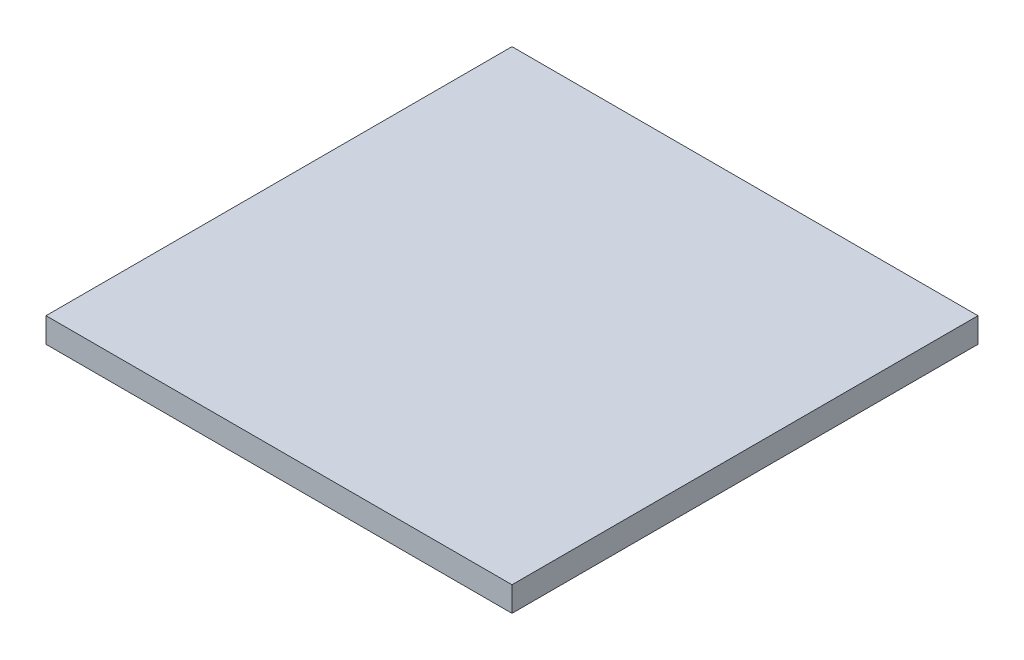
ISO-10303-21;
HEADER;
FILE_DESCRIPTION(('STEP AP214'),'2;1');
FILE_NAME('part.step','',(''),(''),'','','');
FILE_SCHEMA(('AUTOMOTIVE_DESIGN { 1 0 10303 214 1 1 1 1 }'));
ENDSEC;
DATA;
#1=APPLICATION_CONTEXT('core data for automotive mechanical design processes');
#2=APPLICATION_PROTOCOL_DEFINITION('international standard','automotive_design',2000,#1);
#3=PRODUCT_CONTEXT('',#1,'mechanical');
#4=PRODUCT('Part','Part','',(#3));
#5=PRODUCT_RELATED_PRODUCT_CATEGORY('part','',(#4));
#6=PRODUCT_DEFINITION_FORMATION('','',#4);
#7=PRODUCT_DEFINITION_CONTEXT('part definition',#1,'design');
#8=PRODUCT_DEFINITION('design','',#6,#7);
#9=PRODUCT_DEFINITION_SHAPE('','',#8);
#10=(LENGTH_UNIT() NAMED_UNIT(*) SI_UNIT(.MILLI.,.METRE.));
#11=(NAMED_UNIT(*) PLANE_ANGLE_UNIT() SI_UNIT($,.RADIAN.));
#12=(NAMED_UNIT(*) SI_UNIT($,.STERADIAN.) SOLID_ANGLE_UNIT());
#13=UNCERTAINTY_MEASURE_WITH_UNIT(LENGTH_MEASURE(1.E-05),#10,'distance_accuracy_value','');
#14=(GEOMETRIC_REPRESENTATION_CONTEXT(3) GLOBAL_UNCERTAINTY_ASSIGNED_CONTEXT((#13)) GLOBAL_UNIT_ASSIGNED_CONTEXT((#10,
#11,#12)) REPRESENTATION_CONTEXT('',''));
#15=CARTESIAN_POINT('',(0.,0.,0.));
#16=DIRECTION('',(0.,0.,1.));
#17=DIRECTION('',(1.,0.,0.));
#18=AXIS2_PLACEMENT_3D('',#15,#16,#17);
#19=CARTESIAN_POINT('',(18.6869024283733,3.3,-25.3531067702824));
#20=DIRECTION('',(-1.,0.,0.));
#21=DIRECTION('',(0.,0.,1.));
#22=AXIS2_PLACEMENT_3D('',#19,#20,#21);
#23=PLANE('',#22);
#24=DIRECTION('',(0.,0.,-1.));
#25=VECTOR('',#24,1.);
#26=CARTESIAN_POINT('',(18.6869024283733,0.,-25.3531067702824));
#27=LINE('',#26,#25);
#28=CARTESIAN_POINT('',(18.6869024283733,0.,36.6468932297176));
#29=VERTEX_POINT('',#28);
#30=CARTESIAN_POINT('',(18.6869024283733,0.,-25.3531067702824));
#31=VERTEX_POINT('',#30);
#32=EDGE_CURVE('E96',#29,#31,#27,.T.);
#33=ORIENTED_EDGE('',*,*,#32,.T.);
#34=DIRECTION('',(0.,-1.,0.));
#35=VECTOR('',#34,1.);
#36=CARTESIAN_POINT('',(18.6869024283733,3.3,-25.3531067702824));
#37=LINE('',#36,#35);
#38=CARTESIAN_POINT('',(18.6869024283733,3.3,-25.3531067702824));
#39=VERTEX_POINT('',#38);
#40=EDGE_CURVE('E11',#39,#31,#37,.T.);
#41=ORIENTED_EDGE('',*,*,#40,.F.);
#42=DIRECTION('',(0.,0.,-1.));
#43=VECTOR('',#42,1.);
#44=CARTESIAN_POINT('',(18.6869024283733,3.3,-25.3531067702824));
#45=LINE('',#44,#43);
#46=CARTESIAN_POINT('',(18.6869024283733,3.3,36.6468932297176));
#47=VERTEX_POINT('',#46);
#48=EDGE_CURVE('E84',#47,#39,#45,.T.);
#49=ORIENTED_EDGE('',*,*,#48,.F.);
#50=DIRECTION('',(0.,-1.,0.));
#51=VECTOR('',#50,1.);
#52=CARTESIAN_POINT('',(18.6869024283733,3.3,36.6468932297176));
#53=LINE('',#52,#51);
#54=EDGE_CURVE('E92',#47,#29,#53,.T.);
#55=ORIENTED_EDGE('',*,*,#54,.T.);
#56=EDGE_LOOP('',(#33,#41,#49,#55));
#57=FACE_BOUND('',#56,.T.);
#58=ADVANCED_FACE('F33',(#57),#23,.F.);
#59=CARTESIAN_POINT('',(18.6869024283733,3.3,-25.3531067702824));
#60=DIRECTION('',(0.,0.,1.));
#61=DIRECTION('',(1.,0.,0.));
#62=AXIS2_PLACEMENT_3D('',#59,#60,#61);
#63=PLANE('',#62);
#64=DIRECTION('',(-1.,0.,0.));
#65=VECTOR('',#64,1.);
#66=CARTESIAN_POINT('',(18.6869024283733,0.,-25.3531067702824));
#67=LINE('',#66,#65);
#68=CARTESIAN_POINT('',(-43.3130975716267,0.,-25.3531067702824));
#69=VERTEX_POINT('',#68);
#70=EDGE_CURVE('E88',#31,#69,#67,.T.);
#71=ORIENTED_EDGE('',*,*,#70,.T.);
#72=DIRECTION('',(0.,-1.,0.));
#73=VECTOR('',#72,1.);
#74=CARTESIAN_POINT('',(-43.3130975716267,3.3,-25.3531067702824));
#75=LINE('',#74,#73);
#76=CARTESIAN_POINT('',(-43.3130975716267,3.3,-25.3531067702824));
#77=VERTEX_POINT('',#76);
#78=EDGE_CURVE('E41',#77,#69,#75,.T.);
#79=ORIENTED_EDGE('',*,*,#78,.F.);
#80=DIRECTION('',(-1.,0.,0.));
#81=VECTOR('',#80,1.);
#82=CARTESIAN_POINT('',(18.6869024283733,3.3,-25.3531067702824));
#83=LINE('',#82,#81);
#84=EDGE_CURVE('E79',#39,#77,#83,.T.);
#85=ORIENTED_EDGE('',*,*,#84,.F.);
#86=ORIENTED_EDGE('',*,*,#40,.T.);
#87=EDGE_LOOP('',(#71,#79,#85,#86));
#88=FACE_BOUND('',#87,.T.);
#89=ADVANCED_FACE('F87',(#88),#63,.F.);
#90=CARTESIAN_POINT('',(-43.3130975716267,3.3,-25.3531067702824));
#91=DIRECTION('',(1.,0.,0.));
#92=DIRECTION('',(0.,0.,-1.));
#93=AXIS2_PLACEMENT_3D('',#90,#91,#92);
#94=PLANE('',#93);
#95=DIRECTION('',(0.,0.,1.));
#96=VECTOR('',#95,1.);
#97=CARTESIAN_POINT('',(-43.3130975716267,0.,-25.3531067702824));
#98=LINE('',#97,#96);
#99=CARTESIAN_POINT('',(-43.3130975716267,0.,36.6468932297176));
#100=VERTEX_POINT('',#99);
#101=EDGE_CURVE('E66',#69,#100,#98,.T.);
#102=ORIENTED_EDGE('',*,*,#101,.T.);
#103=DIRECTION('',(0.,-1.,0.));
#104=VECTOR('',#103,1.);
#105=CARTESIAN_POINT('',(-43.3130975716267,3.3,36.6468932297176));
#106=LINE('',#105,#104);
#107=CARTESIAN_POINT('',(-43.3130975716267,3.3,36.6468932297176));
#108=VERTEX_POINT('',#107);
#109=EDGE_CURVE('E89',#108,#100,#106,.T.);
#110=ORIENTED_EDGE('',*,*,#109,.F.);
#111=DIRECTION('',(0.,0.,1.));
#112=VECTOR('',#111,1.);
#113=CARTESIAN_POINT('',(-43.3130975716267,3.3,-25.3531067702824));
#114=LINE('',#113,#112);
#115=EDGE_CURVE('E82',#77,#108,#114,.T.);
#116=ORIENTED_EDGE('',*,*,#115,.F.);
#117=ORIENTED_EDGE('',*,*,#78,.T.);
#118=EDGE_LOOP('',(#102,#110,#116,#117));
#119=FACE_BOUND('',#118,.T.);
#120=ADVANCED_FACE('F90',(#119),#94,.F.);
#121=CARTESIAN_POINT('',(18.6869024283733,3.3,36.6468932297176));
#122=DIRECTION('',(0.,0.,-1.));
#123=DIRECTION('',(-1.,0.,0.));
#124=AXIS2_PLACEMENT_3D('',#121,#122,#123);
#125=PLANE('',#124);
#126=DIRECTION('',(1.,0.,0.));
#127=VECTOR('',#126,1.);
#128=CARTESIAN_POINT('',(18.6869024283733,0.,36.6468932297176));
#129=LINE('',#128,#127);
#130=EDGE_CURVE('E72',#100,#29,#129,.T.);
#131=ORIENTED_EDGE('',*,*,#130,.T.);
#132=ORIENTED_EDGE('',*,*,#54,.F.);
#133=DIRECTION('',(1.,0.,0.));
#134=VECTOR('',#133,1.);
#135=CARTESIAN_POINT('',(18.6869024283733,3.3,36.6468932297176));
#136=LINE('',#135,#134);
#137=EDGE_CURVE('E49',#108,#47,#136,.T.);
#138=ORIENTED_EDGE('',*,*,#137,.F.);
#139=ORIENTED_EDGE('',*,*,#109,.T.);
#140=EDGE_LOOP('',(#131,#132,#138,#139));
#141=FACE_BOUND('',#140,.T.);
#142=ADVANCED_FACE('F103',(#141),#125,.F.);
#143=CARTESIAN_POINT('',(0.,3.3,0.));
#144=DIRECTION('',(0.,-1.,0.));
#145=DIRECTION('',(0.,0.,-1.));
#146=AXIS2_PLACEMENT_3D('',#143,#144,#145);
#147=PLANE('',#146);
#148=ORIENTED_EDGE('',*,*,#48,.T.);
#149=ORIENTED_EDGE('',*,*,#84,.T.);
#150=ORIENTED_EDGE('',*,*,#115,.T.);
#151=ORIENTED_EDGE('',*,*,#137,.T.);
#152=EDGE_LOOP('',(#148,#149,#150,#151));
#153=FACE_BOUND('',#152,.T.);
#154=ADVANCED_FACE('F80',(#153),#147,.F.);
#155=CARTESIAN_POINT('',(0.,0.,0.));
#156=DIRECTION('',(0.,-1.,0.));
#157=DIRECTION('',(0.,0.,-1.));
#158=AXIS2_PLACEMENT_3D('',#155,#156,#157);
#159=PLANE('',#158);
#160=ORIENTED_EDGE('',*,*,#32,.F.);
#161=ORIENTED_EDGE('',*,*,#130,.F.);
#162=ORIENTED_EDGE('',*,*,#101,.F.);
#163=ORIENTED_EDGE('',*,*,#70,.F.);
#164=EDGE_LOOP('',(#160,#161,#162,#163));
#165=FACE_BOUND('',#164,.T.);
#166=ADVANCED_FACE('F106',(#165),#159,.T.);
#167=CLOSED_SHELL('',(#58,#89,#120,#142,#154,#166));
#168=MANIFOLD_SOLID_BREP('B2',#167);
#169=ADVANCED_BREP_SHAPE_REPRESENTATION('',(#18,#168),#14);
#170=SHAPE_DEFINITION_REPRESENTATION(#9,#169);
ENDSEC;
END-ISO-10303-21;
